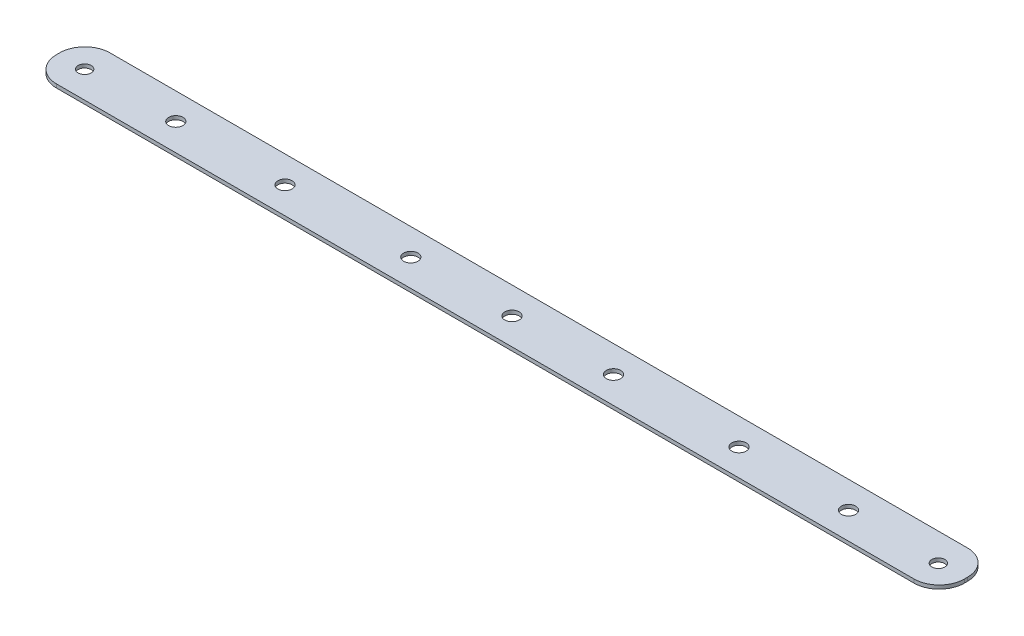
ISO-10303-21;
HEADER;
FILE_DESCRIPTION(('STEP AP214'),'2;1');
FILE_NAME('part.step','',(''),(''),'','','');
FILE_SCHEMA(('AUTOMOTIVE_DESIGN { 1 0 10303 214 1 1 1 1 }'));
ENDSEC;
DATA;
#1=APPLICATION_CONTEXT('core data for automotive mechanical design processes');
#2=APPLICATION_PROTOCOL_DEFINITION('international standard','automotive_design',2000,#1);
#3=PRODUCT_CONTEXT('',#1,'mechanical');
#4=PRODUCT('Part','Part','',(#3));
#5=PRODUCT_RELATED_PRODUCT_CATEGORY('part','',(#4));
#6=PRODUCT_DEFINITION_FORMATION('','',#4);
#7=PRODUCT_DEFINITION_CONTEXT('part definition',#1,'design');
#8=PRODUCT_DEFINITION('design','',#6,#7);
#9=PRODUCT_DEFINITION_SHAPE('','',#8);
#10=(LENGTH_UNIT() NAMED_UNIT(*) SI_UNIT(.MILLI.,.METRE.));
#11=(NAMED_UNIT(*) PLANE_ANGLE_UNIT() SI_UNIT($,.RADIAN.));
#12=(NAMED_UNIT(*) SI_UNIT($,.STERADIAN.) SOLID_ANGLE_UNIT());
#13=UNCERTAINTY_MEASURE_WITH_UNIT(LENGTH_MEASURE(1.E-05),#10,'distance_accuracy_value','');
#14=(GEOMETRIC_REPRESENTATION_CONTEXT(3) GLOBAL_UNCERTAINTY_ASSIGNED_CONTEXT((#13)) GLOBAL_UNIT_ASSIGNED_CONTEXT((#10,
#11,#12)) REPRESENTATION_CONTEXT('',''));
#15=CARTESIAN_POINT('',(0.,0.,0.));
#16=DIRECTION('',(0.,0.,1.));
#17=DIRECTION('',(1.,0.,0.));
#18=AXIS2_PLACEMENT_3D('',#15,#16,#17);
#19=CARTESIAN_POINT('',(-107.95,-0.86,6.37500000000002));
#20=DIRECTION('',(-1.,0.,0.));
#21=DIRECTION('',(0.,0.,1.));
#22=AXIS2_PLACEMENT_3D('',#19,#20,#21);
#23=PLANE('',#22);
#24=DIRECTION('',(0.,0.,1.));
#25=VECTOR('',#24,1.);
#26=CARTESIAN_POINT('',(-107.95,0.,6.37500000000002));
#27=LINE('',#26,#25);
#28=CARTESIAN_POINT('',(-107.95,0.,-0.374999999999985));
#29=VERTEX_POINT('',#28);
#30=CARTESIAN_POINT('',(-107.95,0.,0.375000000000012));
#31=VERTEX_POINT('',#30);
#32=EDGE_CURVE('E108',#29,#31,#27,.T.);
#33=ORIENTED_EDGE('',*,*,#32,.F.);
#34=DIRECTION('',(0.,1.,0.));
#35=VECTOR('',#34,1.);
#36=CARTESIAN_POINT('',(-107.95,-0.86,-0.374999999999985));
#37=LINE('',#36,#35);
#38=CARTESIAN_POINT('',(-107.95,-0.86,-0.374999999999985));
#39=VERTEX_POINT('',#38);
#40=EDGE_CURVE('E11',#29,#39,#37,.F.);
#41=ORIENTED_EDGE('',*,*,#40,.T.);
#42=DIRECTION('',(0.,0.,1.));
#43=VECTOR('',#42,1.);
#44=CARTESIAN_POINT('',(-107.95,-0.86,6.37500000000002));
#45=LINE('',#44,#43);
#46=CARTESIAN_POINT('',(-107.95,-0.86,0.375000000000012));
#47=VERTEX_POINT('',#46);
#48=EDGE_CURVE('E158',#39,#47,#45,.T.);
#49=ORIENTED_EDGE('',*,*,#48,.T.);
#50=DIRECTION('',(0.,1.,0.));
#51=VECTOR('',#50,1.);
#52=CARTESIAN_POINT('',(-107.95,-0.86,0.375000000000012));
#53=LINE('',#52,#51);
#54=EDGE_CURVE('E45',#47,#31,#53,.T.);
#55=ORIENTED_EDGE('',*,*,#54,.T.);
#56=EDGE_LOOP('',(#33,#41,#49,#55));
#57=FACE_BOUND('',#56,.T.);
#58=ADVANCED_FACE('F37',(#57),#23,.T.);
#59=CARTESIAN_POINT('',(107.95,-0.86,-6.37500000000001));
#60=DIRECTION('',(0.,0.,-1.));
#61=DIRECTION('',(-1.,0.,0.));
#62=AXIS2_PLACEMENT_3D('',#59,#60,#61);
#63=PLANE('',#62);
#64=DIRECTION('',(-1.,0.,0.));
#65=VECTOR('',#64,1.);
#66=CARTESIAN_POINT('',(107.95,0.,-6.37500000000001));
#67=LINE('',#66,#65);
#68=CARTESIAN_POINT('',(101.95,0.,-6.375));
#69=VERTEX_POINT('',#68);
#70=CARTESIAN_POINT('',(-101.95,0.,-6.37499999999998));
#71=VERTEX_POINT('',#70);
#72=EDGE_CURVE('E133',#69,#71,#67,.T.);
#73=ORIENTED_EDGE('',*,*,#72,.F.);
#74=DIRECTION('',(0.,1.,0.));
#75=VECTOR('',#74,1.);
#76=CARTESIAN_POINT('',(101.95,-0.86,-6.375));
#77=LINE('',#76,#75);
#78=CARTESIAN_POINT('',(101.95,-0.86,-6.375));
#79=VERTEX_POINT('',#78);
#80=EDGE_CURVE('E59',#69,#79,#77,.F.);
#81=ORIENTED_EDGE('',*,*,#80,.T.);
#82=DIRECTION('',(-1.,0.,0.));
#83=VECTOR('',#82,1.);
#84=CARTESIAN_POINT('',(107.95,-0.86,-6.37500000000001));
#85=LINE('',#84,#83);
#86=CARTESIAN_POINT('',(-101.95,-0.86,-6.37499999999998));
#87=VERTEX_POINT('',#86);
#88=EDGE_CURVE('E127',#79,#87,#85,.T.);
#89=ORIENTED_EDGE('',*,*,#88,.T.);
#90=DIRECTION('',(0.,1.,0.));
#91=VECTOR('',#90,1.);
#92=CARTESIAN_POINT('',(-101.95,-0.86,-6.37499999999998));
#93=LINE('',#92,#91);
#94=EDGE_CURVE('E152',#87,#71,#93,.T.);
#95=ORIENTED_EDGE('',*,*,#94,.T.);
#96=EDGE_LOOP('',(#73,#81,#89,#95));
#97=FACE_BOUND('',#96,.T.);
#98=ADVANCED_FACE('F195',(#97),#63,.T.);
#99=CARTESIAN_POINT('',(107.95,-0.86,6.37499999999999));
#100=DIRECTION('',(1.,0.,0.));
#101=DIRECTION('',(0.,0.,-1.));
#102=AXIS2_PLACEMENT_3D('',#99,#100,#101);
#103=PLANE('',#102);
#104=DIRECTION('',(0.,0.,-1.));
#105=VECTOR('',#104,1.);
#106=CARTESIAN_POINT('',(107.95,0.,6.37499999999999));
#107=LINE('',#106,#105);
#108=CARTESIAN_POINT('',(107.95,0.,0.374999999999993));
#109=VERTEX_POINT('',#108);
#110=CARTESIAN_POINT('',(107.95,0.,-0.375000000000005));
#111=VERTEX_POINT('',#110);
#112=EDGE_CURVE('E123',#109,#111,#107,.T.);
#113=ORIENTED_EDGE('',*,*,#112,.F.);
#114=DIRECTION('',(0.,1.,0.));
#115=VECTOR('',#114,1.);
#116=CARTESIAN_POINT('',(107.95,-0.86,0.374999999999993));
#117=LINE('',#116,#115);
#118=CARTESIAN_POINT('',(107.95,-0.86,0.374999999999993));
#119=VERTEX_POINT('',#118);
#120=EDGE_CURVE('E144',#109,#119,#117,.F.);
#121=ORIENTED_EDGE('',*,*,#120,.T.);
#122=DIRECTION('',(0.,0.,-1.));
#123=VECTOR('',#122,1.);
#124=CARTESIAN_POINT('',(107.95,-0.86,6.37499999999999));
#125=LINE('',#124,#123);
#126=CARTESIAN_POINT('',(107.95,-0.86,-0.375000000000005));
#127=VERTEX_POINT('',#126);
#128=EDGE_CURVE('E130',#119,#127,#125,.T.);
#129=ORIENTED_EDGE('',*,*,#128,.T.);
#130=DIRECTION('',(0.,1.,0.));
#131=VECTOR('',#130,1.);
#132=CARTESIAN_POINT('',(107.95,-0.86,-0.375000000000005));
#133=LINE('',#132,#131);
#134=EDGE_CURVE('E141',#127,#111,#133,.T.);
#135=ORIENTED_EDGE('',*,*,#134,.T.);
#136=EDGE_LOOP('',(#113,#121,#129,#135));
#137=FACE_BOUND('',#136,.T.);
#138=ADVANCED_FACE('F174',(#137),#103,.T.);
#139=CARTESIAN_POINT('',(107.95,-0.86,6.37499999999999));
#140=DIRECTION('',(0.,0.,1.));
#141=DIRECTION('',(1.,0.,0.));
#142=AXIS2_PLACEMENT_3D('',#139,#140,#141);
#143=PLANE('',#142);
#144=DIRECTION('',(1.,0.,0.));
#145=VECTOR('',#144,1.);
#146=CARTESIAN_POINT('',(107.95,-0.86,6.37499999999999));
#147=LINE('',#146,#145);
#148=CARTESIAN_POINT('',(-101.95,-0.86,6.37500000000002));
#149=VERTEX_POINT('',#148);
#150=CARTESIAN_POINT('',(101.95,-0.86,6.37499999999999));
#151=VERTEX_POINT('',#150);
#152=EDGE_CURVE('E159',#149,#151,#147,.T.);
#153=ORIENTED_EDGE('',*,*,#152,.T.);
#154=DIRECTION('',(0.,1.,0.));
#155=VECTOR('',#154,1.);
#156=CARTESIAN_POINT('',(101.95,-0.86,6.37499999999999));
#157=LINE('',#156,#155);
#158=CARTESIAN_POINT('',(101.95,0.,6.37499999999999));
#159=VERTEX_POINT('',#158);
#160=EDGE_CURVE('E114',#151,#159,#157,.T.);
#161=ORIENTED_EDGE('',*,*,#160,.T.);
#162=DIRECTION('',(1.,0.,0.));
#163=VECTOR('',#162,1.);
#164=CARTESIAN_POINT('',(107.95,0.,6.37499999999999));
#165=LINE('',#164,#163);
#166=CARTESIAN_POINT('',(-101.95,0.,6.37500000000002));
#167=VERTEX_POINT('',#166);
#168=EDGE_CURVE('E106',#167,#159,#165,.T.);
#169=ORIENTED_EDGE('',*,*,#168,.F.);
#170=DIRECTION('',(0.,1.,0.));
#171=VECTOR('',#170,1.);
#172=CARTESIAN_POINT('',(-101.95,-0.86,6.37500000000002));
#173=LINE('',#172,#171);
#174=EDGE_CURVE('E120',#167,#149,#173,.F.);
#175=ORIENTED_EDGE('',*,*,#174,.T.);
#176=EDGE_LOOP('',(#153,#161,#169,#175));
#177=FACE_BOUND('',#176,.T.);
#178=ADVANCED_FACE('F119',(#177),#143,.T.);
#179=CARTESIAN_POINT('',(0.,-0.86,0.));
#180=DIRECTION('',(0.,1.,0.));
#181=DIRECTION('',(0.,0.,1.));
#182=AXIS2_PLACEMENT_3D('',#179,#180,#181);
#183=PLANE('',#182);
#184=CARTESIAN_POINT('',(101.601385272546,-0.86,0.242368773103314));
#185=DIRECTION('',(0.,1.,0.));
#186=DIRECTION('',(0.,0.,1.));
#187=AXIS2_PLACEMENT_3D('',#184,#185,#186);
#188=CIRCLE('',#187,1.54999999999999);
#189=CARTESIAN_POINT('',(101.601385272546,-0.86,1.79236877310331));
#190=VERTEX_POINT('',#189);
#191=EDGE_CURVE('E254',#190,#190,#188,.T.);
#192=ORIENTED_EDGE('',*,*,#191,.T.);
#193=EDGE_LOOP('',(#192));
#194=FACE_BOUND('',#193,.T.);
#195=CARTESIAN_POINT('',(0.,-0.86,0.));
#196=DIRECTION('',(0.,1.,0.));
#197=DIRECTION('',(0.,0.,1.));
#198=AXIS2_PLACEMENT_3D('',#195,#196,#197);
#199=CIRCLE('',#198,1.69999999999999);
#200=CARTESIAN_POINT('',(0.,-0.86,1.69999999999999));
#201=VERTEX_POINT('',#200);
#202=EDGE_CURVE('E258',#201,#201,#199,.T.);
#203=ORIENTED_EDGE('',*,*,#202,.T.);
#204=EDGE_LOOP('',(#203));
#205=FACE_BOUND('',#204,.T.);
#206=CARTESIAN_POINT('',(-53.975,-0.86,0.));
#207=DIRECTION('',(0.,1.,0.));
#208=DIRECTION('',(0.,0.,1.));
#209=AXIS2_PLACEMENT_3D('',#206,#207,#208);
#210=CIRCLE('',#209,1.69999999999999);
#211=CARTESIAN_POINT('',(-53.975,-0.86,1.69999999999999));
#212=VERTEX_POINT('',#211);
#213=EDGE_CURVE('E267',#212,#212,#210,.T.);
#214=ORIENTED_EDGE('',*,*,#213,.T.);
#215=EDGE_LOOP('',(#214));
#216=FACE_BOUND('',#215,.T.);
#217=CARTESIAN_POINT('',(53.975,-0.86,0.));
#218=DIRECTION('',(0.,1.,0.));
#219=DIRECTION('',(0.,0.,1.));
#220=AXIS2_PLACEMENT_3D('',#217,#218,#219);
#221=CIRCLE('',#220,1.69999999999999);
#222=CARTESIAN_POINT('',(53.975,-0.86,1.69999999999999));
#223=VERTEX_POINT('',#222);
#224=EDGE_CURVE('E273',#223,#223,#221,.T.);
#225=ORIENTED_EDGE('',*,*,#224,.T.);
#226=EDGE_LOOP('',(#225));
#227=FACE_BOUND('',#226,.T.);
#228=CARTESIAN_POINT('',(-80.0116084127714,-0.86,-0.0752075406612852));
#229=DIRECTION('',(0.,1.,0.));
#230=DIRECTION('',(0.,0.,1.));
#231=AXIS2_PLACEMENT_3D('',#228,#229,#230);
#232=CIRCLE('',#231,1.69999999999999);
#233=CARTESIAN_POINT('',(-80.0116084127714,-0.86,1.62479245933871));
#234=VERTEX_POINT('',#233);
#235=EDGE_CURVE('E279',#234,#234,#232,.T.);
#236=ORIENTED_EDGE('',*,*,#235,.T.);
#237=EDGE_LOOP('',(#236));
#238=FACE_BOUND('',#237,.T.);
#239=CARTESIAN_POINT('',(-24.1316084127714,-0.86,-0.0752075406612853));
#240=DIRECTION('',(0.,1.,0.));
#241=DIRECTION('',(0.,0.,1.));
#242=AXIS2_PLACEMENT_3D('',#239,#240,#241);
#243=CIRCLE('',#242,1.69999999999999);
#244=CARTESIAN_POINT('',(-24.1316084127714,-0.86,1.6247924593387));
#245=VERTEX_POINT('',#244);
#246=EDGE_CURVE('E285',#245,#245,#243,.T.);
#247=ORIENTED_EDGE('',*,*,#246,.T.);
#248=EDGE_LOOP('',(#247));
#249=FACE_BOUND('',#248,.T.);
#250=CARTESIAN_POINT('',(80.01,-0.86,0.));
#251=DIRECTION('',(0.,1.,0.));
#252=DIRECTION('',(0.,0.,1.));
#253=AXIS2_PLACEMENT_3D('',#250,#251,#252);
#254=CIRCLE('',#253,1.69999999999999);
#255=CARTESIAN_POINT('',(80.01,-0.86,1.69999999999999));
#256=VERTEX_POINT('',#255);
#257=EDGE_CURVE('E291',#256,#256,#254,.T.);
#258=ORIENTED_EDGE('',*,*,#257,.T.);
#259=EDGE_LOOP('',(#258));
#260=FACE_BOUND('',#259,.T.);
#261=CARTESIAN_POINT('',(24.13,-0.86,0.));
#262=DIRECTION('',(0.,1.,0.));
#263=DIRECTION('',(0.,0.,1.));
#264=AXIS2_PLACEMENT_3D('',#261,#262,#263);
#265=CIRCLE('',#264,1.69999999999999);
#266=CARTESIAN_POINT('',(24.13,-0.86,1.69999999999999));
#267=VERTEX_POINT('',#266);
#268=EDGE_CURVE('E297',#267,#267,#265,.T.);
#269=ORIENTED_EDGE('',*,*,#268,.T.);
#270=EDGE_LOOP('',(#269));
#271=FACE_BOUND('',#270,.T.);
#272=CARTESIAN_POINT('',(-101.6,-0.86,0.));
#273=DIRECTION('',(0.,1.,0.));
#274=DIRECTION('',(0.,0.,1.));
#275=AXIS2_PLACEMENT_3D('',#272,#273,#274);
#276=CIRCLE('',#275,1.54999999999999);
#277=CARTESIAN_POINT('',(-101.6,-0.86,1.54999999999999));
#278=VERTEX_POINT('',#277);
#279=EDGE_CURVE('E169',#278,#278,#276,.T.);
#280=ORIENTED_EDGE('',*,*,#279,.T.);
#281=EDGE_LOOP('',(#280));
#282=FACE_BOUND('',#281,.T.);
#283=ORIENTED_EDGE('',*,*,#128,.F.);
#284=CARTESIAN_POINT('',(101.95,-0.86,0.374999999999992));
#285=DIRECTION('',(0.,1.,0.));
#286=DIRECTION('',(0.,0.,1.));
#287=AXIS2_PLACEMENT_3D('',#284,#285,#286);
#288=CIRCLE('',#287,6.);
#289=EDGE_CURVE('E150',#119,#151,#288,.F.);
#290=ORIENTED_EDGE('',*,*,#289,.T.);
#291=ORIENTED_EDGE('',*,*,#152,.F.);
#292=CARTESIAN_POINT('',(-101.95,-0.86,0.375000000000019));
#293=DIRECTION('',(0.,1.,0.));
#294=DIRECTION('',(0.,0.,1.));
#295=AXIS2_PLACEMENT_3D('',#292,#293,#294);
#296=CIRCLE('',#295,6.);
#297=EDGE_CURVE('E126',#149,#47,#296,.F.);
#298=ORIENTED_EDGE('',*,*,#297,.T.);
#299=ORIENTED_EDGE('',*,*,#48,.F.);
#300=CARTESIAN_POINT('',(-101.95,-0.86,-0.374999999999979));
#301=DIRECTION('',(0.,1.,0.));
#302=DIRECTION('',(0.,0.,1.));
#303=AXIS2_PLACEMENT_3D('',#300,#301,#302);
#304=CIRCLE('',#303,6.);
#305=EDGE_CURVE('E52',#39,#87,#304,.F.);
#306=ORIENTED_EDGE('',*,*,#305,.T.);
#307=ORIENTED_EDGE('',*,*,#88,.F.);
#308=CARTESIAN_POINT('',(101.95,-0.86,-0.375000000000005));
#309=DIRECTION('',(0.,1.,0.));
#310=DIRECTION('',(0.,0.,1.));
#311=AXIS2_PLACEMENT_3D('',#308,#309,#310);
#312=CIRCLE('',#311,6.);
#313=EDGE_CURVE('E148',#79,#127,#312,.F.);
#314=ORIENTED_EDGE('',*,*,#313,.T.);
#315=EDGE_LOOP('',(#283,#290,#291,#298,#299,#306,#307,#314));
#316=FACE_BOUND('',#315,.T.);
#317=ADVANCED_FACE('F180',(#194,#205,#216,#227,#238,#249,#260,#271,#282,#316),#183,.F.);
#318=CARTESIAN_POINT('',(0.,0.,0.));
#319=DIRECTION('',(0.,1.,0.));
#320=DIRECTION('',(0.,0.,1.));
#321=AXIS2_PLACEMENT_3D('',#318,#319,#320);
#322=PLANE('',#321);
#323=CARTESIAN_POINT('',(101.601385272546,0.,0.242368773103314));
#324=DIRECTION('',(0.,1.,0.));
#325=DIRECTION('',(0.,0.,1.));
#326=AXIS2_PLACEMENT_3D('',#323,#324,#325);
#327=CIRCLE('',#326,1.54999999999999);
#328=CARTESIAN_POINT('',(101.601385272546,0.,1.79236877310331));
#329=VERTEX_POINT('',#328);
#330=EDGE_CURVE('E251',#329,#329,#327,.T.);
#331=ORIENTED_EDGE('',*,*,#330,.F.);
#332=EDGE_LOOP('',(#331));
#333=FACE_BOUND('',#332,.T.);
#334=CARTESIAN_POINT('',(0.,0.,0.));
#335=DIRECTION('',(0.,1.,0.));
#336=DIRECTION('',(0.,0.,1.));
#337=AXIS2_PLACEMENT_3D('',#334,#335,#336);
#338=CIRCLE('',#337,1.69999999999999);
#339=CARTESIAN_POINT('',(0.,0.,1.69999999999999));
#340=VERTEX_POINT('',#339);
#341=EDGE_CURVE('E255',#340,#340,#338,.T.);
#342=ORIENTED_EDGE('',*,*,#341,.F.);
#343=EDGE_LOOP('',(#342));
#344=FACE_BOUND('',#343,.T.);
#345=CARTESIAN_POINT('',(-53.975,0.,0.));
#346=DIRECTION('',(0.,1.,0.));
#347=DIRECTION('',(0.,0.,1.));
#348=AXIS2_PLACEMENT_3D('',#345,#346,#347);
#349=CIRCLE('',#348,1.69999999999999);
#350=CARTESIAN_POINT('',(-53.975,0.,1.69999999999999));
#351=VERTEX_POINT('',#350);
#352=EDGE_CURVE('E264',#351,#351,#349,.T.);
#353=ORIENTED_EDGE('',*,*,#352,.F.);
#354=EDGE_LOOP('',(#353));
#355=FACE_BOUND('',#354,.T.);
#356=CARTESIAN_POINT('',(53.975,0.,0.));
#357=DIRECTION('',(0.,1.,0.));
#358=DIRECTION('',(0.,0.,1.));
#359=AXIS2_PLACEMENT_3D('',#356,#357,#358);
#360=CIRCLE('',#359,1.69999999999999);
#361=CARTESIAN_POINT('',(53.975,0.,1.69999999999999));
#362=VERTEX_POINT('',#361);
#363=EDGE_CURVE('E270',#362,#362,#360,.T.);
#364=ORIENTED_EDGE('',*,*,#363,.F.);
#365=EDGE_LOOP('',(#364));
#366=FACE_BOUND('',#365,.T.);
#367=CARTESIAN_POINT('',(-80.0116084127714,0.,-0.0752075406612852));
#368=DIRECTION('',(0.,1.,0.));
#369=DIRECTION('',(0.,0.,1.));
#370=AXIS2_PLACEMENT_3D('',#367,#368,#369);
#371=CIRCLE('',#370,1.69999999999999);
#372=CARTESIAN_POINT('',(-80.0116084127714,0.,1.62479245933871));
#373=VERTEX_POINT('',#372);
#374=EDGE_CURVE('E276',#373,#373,#371,.T.);
#375=ORIENTED_EDGE('',*,*,#374,.F.);
#376=EDGE_LOOP('',(#375));
#377=FACE_BOUND('',#376,.T.);
#378=CARTESIAN_POINT('',(-24.1316084127714,0.,-0.0752075406612853));
#379=DIRECTION('',(0.,1.,0.));
#380=DIRECTION('',(0.,0.,1.));
#381=AXIS2_PLACEMENT_3D('',#378,#379,#380);
#382=CIRCLE('',#381,1.69999999999999);
#383=CARTESIAN_POINT('',(-24.1316084127714,0.,1.6247924593387));
#384=VERTEX_POINT('',#383);
#385=EDGE_CURVE('E282',#384,#384,#382,.T.);
#386=ORIENTED_EDGE('',*,*,#385,.F.);
#387=EDGE_LOOP('',(#386));
#388=FACE_BOUND('',#387,.T.);
#389=CARTESIAN_POINT('',(80.01,0.,0.));
#390=DIRECTION('',(0.,1.,0.));
#391=DIRECTION('',(0.,0.,1.));
#392=AXIS2_PLACEMENT_3D('',#389,#390,#391);
#393=CIRCLE('',#392,1.69999999999999);
#394=CARTESIAN_POINT('',(80.01,0.,1.69999999999999));
#395=VERTEX_POINT('',#394);
#396=EDGE_CURVE('E288',#395,#395,#393,.T.);
#397=ORIENTED_EDGE('',*,*,#396,.F.);
#398=EDGE_LOOP('',(#397));
#399=FACE_BOUND('',#398,.T.);
#400=CARTESIAN_POINT('',(24.13,0.,0.));
#401=DIRECTION('',(0.,1.,0.));
#402=DIRECTION('',(0.,0.,1.));
#403=AXIS2_PLACEMENT_3D('',#400,#401,#402);
#404=CIRCLE('',#403,1.69999999999999);
#405=CARTESIAN_POINT('',(24.13,0.,1.69999999999999));
#406=VERTEX_POINT('',#405);
#407=EDGE_CURVE('E294',#406,#406,#404,.T.);
#408=ORIENTED_EDGE('',*,*,#407,.F.);
#409=EDGE_LOOP('',(#408));
#410=FACE_BOUND('',#409,.T.);
#411=CARTESIAN_POINT('',(-101.6,0.,0.));
#412=DIRECTION('',(0.,1.,0.));
#413=DIRECTION('',(0.,0.,1.));
#414=AXIS2_PLACEMENT_3D('',#411,#412,#413);
#415=CIRCLE('',#414,1.54999999999999);
#416=CARTESIAN_POINT('',(-101.6,0.,1.54999999999999));
#417=VERTEX_POINT('',#416);
#418=EDGE_CURVE('E164',#417,#417,#415,.T.);
#419=ORIENTED_EDGE('',*,*,#418,.F.);
#420=EDGE_LOOP('',(#419));
#421=FACE_BOUND('',#420,.T.);
#422=ORIENTED_EDGE('',*,*,#168,.T.);
#423=CARTESIAN_POINT('',(101.95,0.,0.374999999999992));
#424=DIRECTION('',(0.,1.,0.));
#425=DIRECTION('',(0.,0.,1.));
#426=AXIS2_PLACEMENT_3D('',#423,#424,#425);
#427=CIRCLE('',#426,6.);
#428=EDGE_CURVE('E139',#159,#109,#427,.T.);
#429=ORIENTED_EDGE('',*,*,#428,.T.);
#430=ORIENTED_EDGE('',*,*,#112,.T.);
#431=CARTESIAN_POINT('',(101.95,0.,-0.375000000000005));
#432=DIRECTION('',(0.,1.,0.));
#433=DIRECTION('',(0.,0.,1.));
#434=AXIS2_PLACEMENT_3D('',#431,#432,#433);
#435=CIRCLE('',#434,6.);
#436=EDGE_CURVE('E137',#111,#69,#435,.T.);
#437=ORIENTED_EDGE('',*,*,#436,.T.);
#438=ORIENTED_EDGE('',*,*,#72,.T.);
#439=CARTESIAN_POINT('',(-101.95,0.,-0.374999999999979));
#440=DIRECTION('',(0.,1.,0.));
#441=DIRECTION('',(0.,0.,1.));
#442=AXIS2_PLACEMENT_3D('',#439,#440,#441);
#443=CIRCLE('',#442,6.);
#444=EDGE_CURVE('E113',#71,#29,#443,.T.);
#445=ORIENTED_EDGE('',*,*,#444,.T.);
#446=ORIENTED_EDGE('',*,*,#32,.T.);
#447=CARTESIAN_POINT('',(-101.95,0.,0.375000000000019));
#448=DIRECTION('',(0.,1.,0.));
#449=DIRECTION('',(0.,0.,1.));
#450=AXIS2_PLACEMENT_3D('',#447,#448,#449);
#451=CIRCLE('',#450,6.);
#452=EDGE_CURVE('E103',#31,#167,#451,.T.);
#453=ORIENTED_EDGE('',*,*,#452,.T.);
#454=EDGE_LOOP('',(#422,#429,#430,#437,#438,#445,#446,#453));
#455=FACE_BOUND('',#454,.T.);
#456=ADVANCED_FACE('F105',(#333,#344,#355,#366,#377,#388,#399,#410,#421,#455),#322,.T.);
#457=CARTESIAN_POINT('',(-101.6,-0.86,0.));
#458=DIRECTION('',(0.,1.,0.));
#459=DIRECTION('',(0.,0.,1.));
#460=AXIS2_PLACEMENT_3D('',#457,#458,#459);
#461=CYLINDRICAL_SURFACE('',#460,1.54999999999999);
#462=ORIENTED_EDGE('',*,*,#279,.F.);
#463=EDGE_LOOP('',(#462));
#464=FACE_BOUND('',#463,.T.);
#465=ORIENTED_EDGE('',*,*,#418,.T.);
#466=EDGE_LOOP('',(#465));
#467=FACE_BOUND('',#466,.T.);
#468=ADVANCED_FACE('F192',(#464,#467),#461,.F.);
#469=CARTESIAN_POINT('',(101.95,-0.86,0.374999999999992));
#470=DIRECTION('',(0.,1.,0.));
#471=DIRECTION('',(0.,0.,1.));
#472=AXIS2_PLACEMENT_3D('',#469,#470,#471);
#473=CYLINDRICAL_SURFACE('',#472,6.);
#474=ORIENTED_EDGE('',*,*,#289,.F.);
#475=ORIENTED_EDGE('',*,*,#120,.F.);
#476=ORIENTED_EDGE('',*,*,#428,.F.);
#477=ORIENTED_EDGE('',*,*,#160,.F.);
#478=EDGE_LOOP('',(#474,#475,#476,#477));
#479=FACE_BOUND('',#478,.T.);
#480=ADVANCED_FACE('F179',(#479),#473,.T.);
#481=CARTESIAN_POINT('',(101.95,-0.86,-0.375000000000005));
#482=DIRECTION('',(0.,1.,0.));
#483=DIRECTION('',(0.,0.,1.));
#484=AXIS2_PLACEMENT_3D('',#481,#482,#483);
#485=CYLINDRICAL_SURFACE('',#484,6.);
#486=ORIENTED_EDGE('',*,*,#313,.F.);
#487=ORIENTED_EDGE('',*,*,#80,.F.);
#488=ORIENTED_EDGE('',*,*,#436,.F.);
#489=ORIENTED_EDGE('',*,*,#134,.F.);
#490=EDGE_LOOP('',(#486,#487,#488,#489));
#491=FACE_BOUND('',#490,.T.);
#492=ADVANCED_FACE('F183',(#491),#485,.T.);
#493=CARTESIAN_POINT('',(-101.95,-0.86,-0.374999999999979));
#494=DIRECTION('',(0.,1.,0.));
#495=DIRECTION('',(0.,0.,1.));
#496=AXIS2_PLACEMENT_3D('',#493,#494,#495);
#497=CYLINDRICAL_SURFACE('',#496,6.);
#498=ORIENTED_EDGE('',*,*,#305,.F.);
#499=ORIENTED_EDGE('',*,*,#40,.F.);
#500=ORIENTED_EDGE('',*,*,#444,.F.);
#501=ORIENTED_EDGE('',*,*,#94,.F.);
#502=EDGE_LOOP('',(#498,#499,#500,#501));
#503=FACE_BOUND('',#502,.T.);
#504=ADVANCED_FACE('F185',(#503),#497,.T.);
#505=CARTESIAN_POINT('',(-101.95,-0.86,0.375000000000019));
#506=DIRECTION('',(0.,1.,0.));
#507=DIRECTION('',(0.,0.,1.));
#508=AXIS2_PLACEMENT_3D('',#505,#506,#507);
#509=CYLINDRICAL_SURFACE('',#508,6.);
#510=ORIENTED_EDGE('',*,*,#297,.F.);
#511=ORIENTED_EDGE('',*,*,#174,.F.);
#512=ORIENTED_EDGE('',*,*,#452,.F.);
#513=ORIENTED_EDGE('',*,*,#54,.F.);
#514=EDGE_LOOP('',(#510,#511,#512,#513));
#515=FACE_BOUND('',#514,.T.);
#516=ADVANCED_FACE('F39',(#515),#509,.T.);
#517=CARTESIAN_POINT('',(24.13,0.,0.));
#518=DIRECTION('',(0.,1.,0.));
#519=DIRECTION('',(0.,0.,1.));
#520=AXIS2_PLACEMENT_3D('',#517,#518,#519);
#521=CYLINDRICAL_SURFACE('',#520,1.69999999999999);
#522=ORIENTED_EDGE('',*,*,#407,.T.);
#523=EDGE_LOOP('',(#522));
#524=FACE_BOUND('',#523,.T.);
#525=ORIENTED_EDGE('',*,*,#268,.F.);
#526=EDGE_LOOP('',(#525));
#527=FACE_BOUND('',#526,.T.);
#528=ADVANCED_FACE('F215',(#524,#527),#521,.F.);
#529=CARTESIAN_POINT('',(80.01,0.,0.));
#530=DIRECTION('',(0.,1.,0.));
#531=DIRECTION('',(0.,0.,1.));
#532=AXIS2_PLACEMENT_3D('',#529,#530,#531);
#533=CYLINDRICAL_SURFACE('',#532,1.69999999999999);
#534=ORIENTED_EDGE('',*,*,#396,.T.);
#535=EDGE_LOOP('',(#534));
#536=FACE_BOUND('',#535,.T.);
#537=ORIENTED_EDGE('',*,*,#257,.F.);
#538=EDGE_LOOP('',(#537));
#539=FACE_BOUND('',#538,.T.);
#540=ADVANCED_FACE('F218',(#536,#539),#533,.F.);
#541=CARTESIAN_POINT('',(-24.1316084127714,0.,-0.0752075406612853));
#542=DIRECTION('',(0.,1.,0.));
#543=DIRECTION('',(0.,0.,1.));
#544=AXIS2_PLACEMENT_3D('',#541,#542,#543);
#545=CYLINDRICAL_SURFACE('',#544,1.69999999999999);
#546=ORIENTED_EDGE('',*,*,#385,.T.);
#547=EDGE_LOOP('',(#546));
#548=FACE_BOUND('',#547,.T.);
#549=ORIENTED_EDGE('',*,*,#246,.F.);
#550=EDGE_LOOP('',(#549));
#551=FACE_BOUND('',#550,.T.);
#552=ADVANCED_FACE('F222',(#548,#551),#545,.F.);
#553=CARTESIAN_POINT('',(-80.0116084127714,0.,-0.0752075406612852));
#554=DIRECTION('',(0.,1.,0.));
#555=DIRECTION('',(0.,0.,1.));
#556=AXIS2_PLACEMENT_3D('',#553,#554,#555);
#557=CYLINDRICAL_SURFACE('',#556,1.69999999999999);
#558=ORIENTED_EDGE('',*,*,#374,.T.);
#559=EDGE_LOOP('',(#558));
#560=FACE_BOUND('',#559,.T.);
#561=ORIENTED_EDGE('',*,*,#235,.F.);
#562=EDGE_LOOP('',(#561));
#563=FACE_BOUND('',#562,.T.);
#564=ADVANCED_FACE('F226',(#560,#563),#557,.F.);
#565=CARTESIAN_POINT('',(53.975,0.,0.));
#566=DIRECTION('',(0.,1.,0.));
#567=DIRECTION('',(0.,0.,1.));
#568=AXIS2_PLACEMENT_3D('',#565,#566,#567);
#569=CYLINDRICAL_SURFACE('',#568,1.69999999999999);
#570=ORIENTED_EDGE('',*,*,#363,.T.);
#571=EDGE_LOOP('',(#570));
#572=FACE_BOUND('',#571,.T.);
#573=ORIENTED_EDGE('',*,*,#224,.F.);
#574=EDGE_LOOP('',(#573));
#575=FACE_BOUND('',#574,.T.);
#576=ADVANCED_FACE('F230',(#572,#575),#569,.F.);
#577=CARTESIAN_POINT('',(-53.975,0.,0.));
#578=DIRECTION('',(0.,1.,0.));
#579=DIRECTION('',(0.,0.,1.));
#580=AXIS2_PLACEMENT_3D('',#577,#578,#579);
#581=CYLINDRICAL_SURFACE('',#580,1.69999999999999);
#582=ORIENTED_EDGE('',*,*,#352,.T.);
#583=EDGE_LOOP('',(#582));
#584=FACE_BOUND('',#583,.T.);
#585=ORIENTED_EDGE('',*,*,#213,.F.);
#586=EDGE_LOOP('',(#585));
#587=FACE_BOUND('',#586,.T.);
#588=ADVANCED_FACE('F234',(#584,#587),#581,.F.);
#589=CARTESIAN_POINT('',(0.,0.,0.));
#590=DIRECTION('',(0.,1.,0.));
#591=DIRECTION('',(0.,0.,1.));
#592=AXIS2_PLACEMENT_3D('',#589,#590,#591);
#593=CYLINDRICAL_SURFACE('',#592,1.69999999999999);
#594=ORIENTED_EDGE('',*,*,#341,.T.);
#595=EDGE_LOOP('',(#594));
#596=FACE_BOUND('',#595,.T.);
#597=ORIENTED_EDGE('',*,*,#202,.F.);
#598=EDGE_LOOP('',(#597));
#599=FACE_BOUND('',#598,.T.);
#600=ADVANCED_FACE('F238',(#596,#599),#593,.F.);
#601=CARTESIAN_POINT('',(101.601385272546,-82.,0.242368773103314));
#602=DIRECTION('',(0.,1.,0.));
#603=DIRECTION('',(0.,0.,1.));
#604=AXIS2_PLACEMENT_3D('',#601,#602,#603);
#605=CYLINDRICAL_SURFACE('',#604,1.54999999999999);
#606=ORIENTED_EDGE('',*,*,#330,.T.);
#607=EDGE_LOOP('',(#606));
#608=FACE_BOUND('',#607,.T.);
#609=ORIENTED_EDGE('',*,*,#191,.F.);
#610=EDGE_LOOP('',(#609));
#611=FACE_BOUND('',#610,.T.);
#612=ADVANCED_FACE('F242',(#608,#611),#605,.F.);
#613=CLOSED_SHELL('',(#58,#98,#138,#178,#317,#456,#468,#480,#492,#504,#516,#528,#540,#552,#564,
#576,#588,#600,#612));
#614=MANIFOLD_SOLID_BREP('B2',#613);
#615=ADVANCED_BREP_SHAPE_REPRESENTATION('',(#18,#614),#14);
#616=SHAPE_DEFINITION_REPRESENTATION(#9,#615);
ENDSEC;
END-ISO-10303-21;
